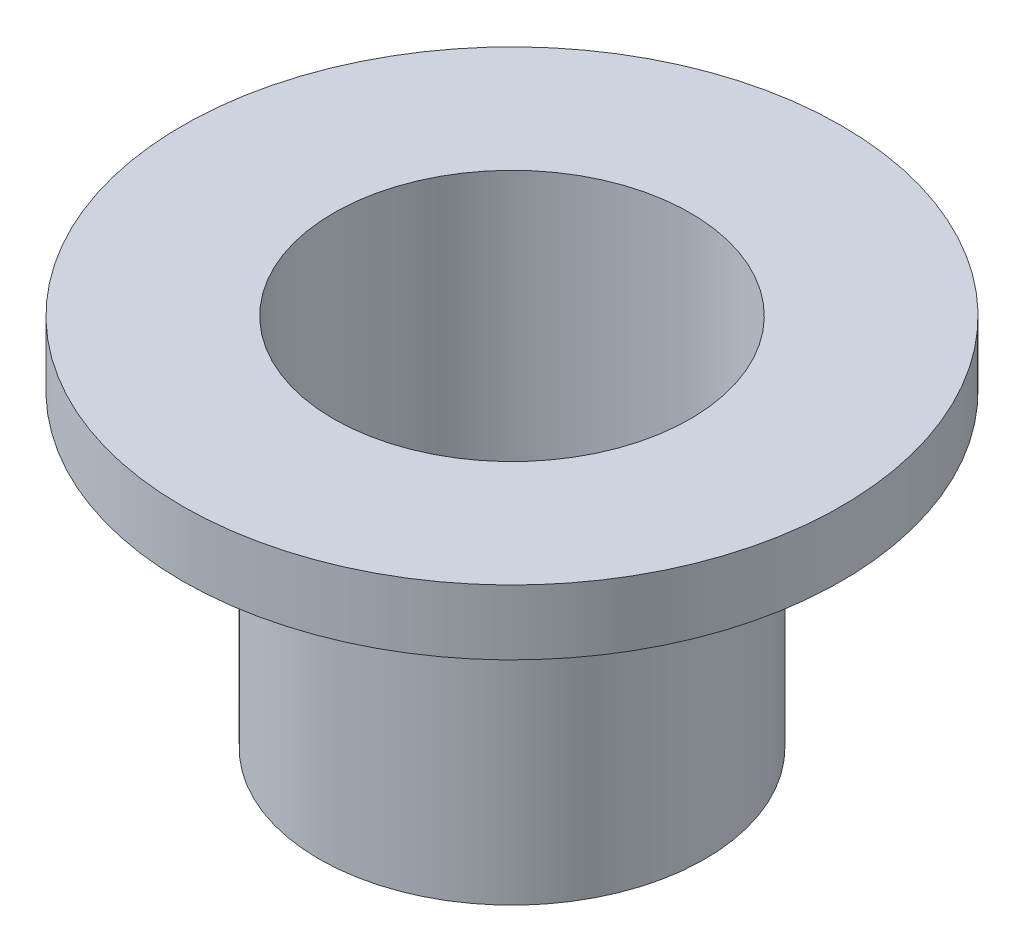
ISO-10303-21;
HEADER;
FILE_DESCRIPTION(('STEP AP214'),'2;1');
FILE_NAME('part.step','',(''),(''),'','','');
FILE_SCHEMA(('AUTOMOTIVE_DESIGN { 1 0 10303 214 1 1 1 1 }'));
ENDSEC;
DATA;
#1=APPLICATION_CONTEXT('core data for automotive mechanical design processes');
#2=APPLICATION_PROTOCOL_DEFINITION('international standard','automotive_design',2000,#1);
#3=PRODUCT_CONTEXT('',#1,'mechanical');
#4=PRODUCT('Part','Part','',(#3));
#5=PRODUCT_RELATED_PRODUCT_CATEGORY('part','',(#4));
#6=PRODUCT_DEFINITION_FORMATION('','',#4);
#7=PRODUCT_DEFINITION_CONTEXT('part definition',#1,'design');
#8=PRODUCT_DEFINITION('design','',#6,#7);
#9=PRODUCT_DEFINITION_SHAPE('','',#8);
#10=(LENGTH_UNIT() NAMED_UNIT(*) SI_UNIT(.MILLI.,.METRE.));
#11=(NAMED_UNIT(*) PLANE_ANGLE_UNIT() SI_UNIT($,.RADIAN.));
#12=(NAMED_UNIT(*) SI_UNIT($,.STERADIAN.) SOLID_ANGLE_UNIT());
#13=UNCERTAINTY_MEASURE_WITH_UNIT(LENGTH_MEASURE(1.E-05),#10,'distance_accuracy_value','');
#14=(GEOMETRIC_REPRESENTATION_CONTEXT(3) GLOBAL_UNCERTAINTY_ASSIGNED_CONTEXT((#13)) GLOBAL_UNIT_ASSIGNED_CONTEXT((#10,
#11,#12)) REPRESENTATION_CONTEXT('',''));
#15=CARTESIAN_POINT('',(0.,0.,0.));
#16=DIRECTION('',(0.,0.,1.));
#17=DIRECTION('',(1.,0.,0.));
#18=AXIS2_PLACEMENT_3D('',#15,#16,#17);
#19=CARTESIAN_POINT('',(0.,0.,-2.75));
#20=DIRECTION('',(0.,1.,0.));
#21=DIRECTION('',(0.,0.,1.));
#22=AXIS2_PLACEMENT_3D('',#19,#20,#21);
#23=PLANE('',#22);
#24=CARTESIAN_POINT('',(0.,0.,0.));
#25=DIRECTION('',(0.,1.,0.));
#26=DIRECTION('',(0.,0.,1.));
#27=AXIS2_PLACEMENT_3D('',#24,#25,#26);
#28=CIRCLE('',#27,2.975);
#29=CARTESIAN_POINT('',(0.,0.,2.975));
#30=VERTEX_POINT('',#29);
#31=EDGE_CURVE('E10',#30,#30,#28,.T.);
#32=ORIENTED_EDGE('',*,*,#31,.F.);
#33=EDGE_LOOP('',(#32));
#34=FACE_BOUND('',#33,.T.);
#35=CARTESIAN_POINT('',(0.,0.,0.));
#36=DIRECTION('',(0.,1.,0.));
#37=DIRECTION('',(0.,0.,1.));
#38=AXIS2_PLACEMENT_3D('',#35,#36,#37);
#39=CIRCLE('',#38,2.75);
#40=CARTESIAN_POINT('',(0.,0.,2.75));
#41=VERTEX_POINT('',#40);
#42=EDGE_CURVE('E64',#41,#41,#39,.T.);
#43=ORIENTED_EDGE('',*,*,#42,.T.);
#44=EDGE_LOOP('',(#43));
#45=FACE_BOUND('',#44,.T.);
#46=ADVANCED_FACE('F37',(#34,#45),#23,.F.);
#47=CARTESIAN_POINT('',(0.,12.1046875,0.));
#48=DIRECTION('',(0.,1.,0.));
#49=DIRECTION('',(0.,0.,1.));
#50=AXIS2_PLACEMENT_3D('',#47,#48,#49);
#51=CYLINDRICAL_SURFACE('',#50,2.975);
#52=CARTESIAN_POINT('',(0.,4.7625,0.));
#53=DIRECTION('',(0.,1.,0.));
#54=DIRECTION('',(0.,0.,1.));
#55=AXIS2_PLACEMENT_3D('',#52,#53,#54);
#56=CIRCLE('',#55,2.975);
#57=CARTESIAN_POINT('',(0.,4.7625,2.975));
#58=VERTEX_POINT('',#57);
#59=EDGE_CURVE('E44',#58,#58,#56,.T.);
#60=ORIENTED_EDGE('',*,*,#59,.F.);
#61=EDGE_LOOP('',(#60));
#62=FACE_BOUND('',#61,.T.);
#63=ORIENTED_EDGE('',*,*,#31,.T.);
#64=EDGE_LOOP('',(#63));
#65=FACE_BOUND('',#64,.T.);
#66=ADVANCED_FACE('F90',(#62,#65),#51,.T.);
#67=CARTESIAN_POINT('',(0.,4.7625,-2.975));
#68=DIRECTION('',(0.,1.,0.));
#69=DIRECTION('',(0.,0.,1.));
#70=AXIS2_PLACEMENT_3D('',#67,#68,#69);
#71=PLANE('',#70);
#72=CARTESIAN_POINT('',(0.,4.7625,0.));
#73=DIRECTION('',(0.,1.,0.));
#74=DIRECTION('',(0.,0.,1.));
#75=AXIS2_PLACEMENT_3D('',#72,#73,#74);
#76=CIRCLE('',#75,5.08);
#77=CARTESIAN_POINT('',(0.,4.7625,5.08));
#78=VERTEX_POINT('',#77);
#79=EDGE_CURVE('E49',#78,#78,#76,.T.);
#80=ORIENTED_EDGE('',*,*,#79,.F.);
#81=EDGE_LOOP('',(#80));
#82=FACE_BOUND('',#81,.T.);
#83=ORIENTED_EDGE('',*,*,#59,.T.);
#84=EDGE_LOOP('',(#83));
#85=FACE_BOUND('',#84,.T.);
#86=ADVANCED_FACE('F85',(#82,#85),#71,.F.);
#87=CARTESIAN_POINT('',(0.,12.1046875,0.));
#88=DIRECTION('',(0.,1.,0.));
#89=DIRECTION('',(0.,0.,1.));
#90=AXIS2_PLACEMENT_3D('',#87,#88,#89);
#91=CYLINDRICAL_SURFACE('',#90,5.08);
#92=CARTESIAN_POINT('',(0.,5.7625,0.));
#93=DIRECTION('',(0.,1.,0.));
#94=DIRECTION('',(0.,0.,1.));
#95=AXIS2_PLACEMENT_3D('',#92,#93,#94);
#96=CIRCLE('',#95,5.08);
#97=CARTESIAN_POINT('',(0.,5.7625,5.08));
#98=VERTEX_POINT('',#97);
#99=EDGE_CURVE('E54',#98,#98,#96,.T.);
#100=ORIENTED_EDGE('',*,*,#99,.F.);
#101=EDGE_LOOP('',(#100));
#102=FACE_BOUND('',#101,.T.);
#103=ORIENTED_EDGE('',*,*,#79,.T.);
#104=EDGE_LOOP('',(#103));
#105=FACE_BOUND('',#104,.T.);
#106=ADVANCED_FACE('F79',(#102,#105),#91,.T.);
#107=CARTESIAN_POINT('',(0.,5.7625,-5.08));
#108=DIRECTION('',(0.,-1.,0.));
#109=DIRECTION('',(0.,0.,-1.));
#110=AXIS2_PLACEMENT_3D('',#107,#108,#109);
#111=PLANE('',#110);
#112=CARTESIAN_POINT('',(0.,5.7625,0.));
#113=DIRECTION('',(0.,1.,0.));
#114=DIRECTION('',(0.,0.,1.));
#115=AXIS2_PLACEMENT_3D('',#112,#113,#114);
#116=CIRCLE('',#115,2.75);
#117=CARTESIAN_POINT('',(0.,5.7625,2.75));
#118=VERTEX_POINT('',#117);
#119=EDGE_CURVE('E60',#118,#118,#116,.T.);
#120=ORIENTED_EDGE('',*,*,#119,.F.);
#121=EDGE_LOOP('',(#120));
#122=FACE_BOUND('',#121,.T.);
#123=ORIENTED_EDGE('',*,*,#99,.T.);
#124=EDGE_LOOP('',(#123));
#125=FACE_BOUND('',#124,.T.);
#126=ADVANCED_FACE('F73',(#122,#125),#111,.F.);
#127=CARTESIAN_POINT('',(0.,12.1046875,0.));
#128=DIRECTION('',(0.,1.,0.));
#129=DIRECTION('',(0.,0.,1.));
#130=AXIS2_PLACEMENT_3D('',#127,#128,#129);
#131=CYLINDRICAL_SURFACE('',#130,2.75);
#132=ORIENTED_EDGE('',*,*,#42,.F.);
#133=EDGE_LOOP('',(#132));
#134=FACE_BOUND('',#133,.T.);
#135=ORIENTED_EDGE('',*,*,#119,.T.);
#136=EDGE_LOOP('',(#135));
#137=FACE_BOUND('',#136,.T.);
#138=ADVANCED_FACE('F70',(#134,#137),#131,.F.);
#139=CLOSED_SHELL('',(#46,#66,#86,#106,#126,#138));
#140=MANIFOLD_SOLID_BREP('B2',#139);
#141=ADVANCED_BREP_SHAPE_REPRESENTATION('',(#18,#140),#14);
#142=SHAPE_DEFINITION_REPRESENTATION(#9,#141);
ENDSEC;
END-ISO-10303-21;
